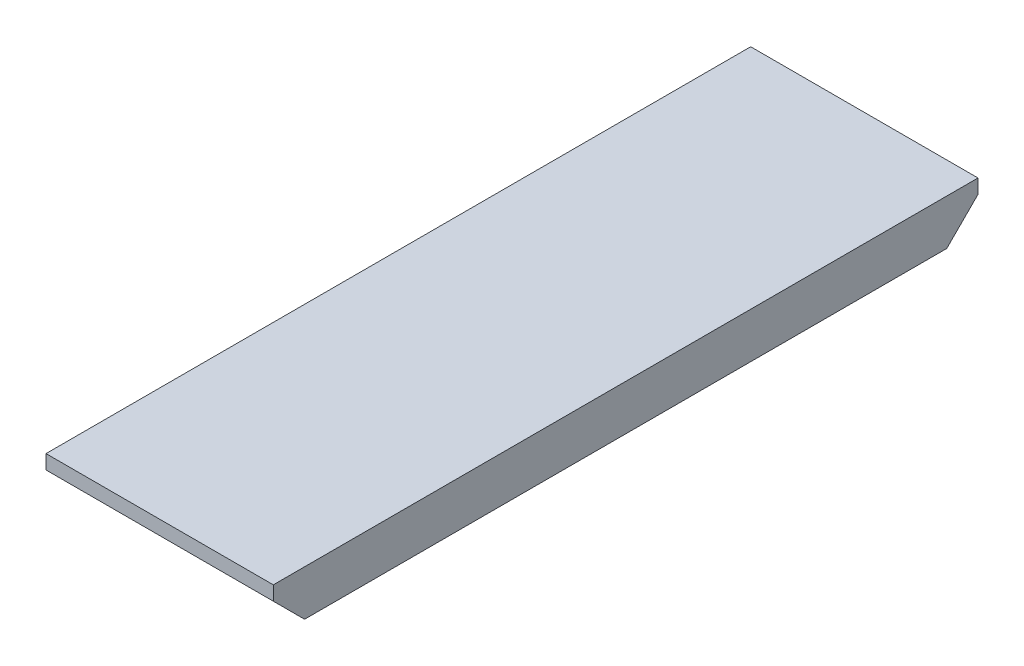
ISO-10303-21;
HEADER;
FILE_DESCRIPTION(('STEP AP214'),'2;1');
FILE_NAME('part.step','',(''),(''),'','','');
FILE_SCHEMA(('AUTOMOTIVE_DESIGN { 1 0 10303 214 1 1 1 1 }'));
ENDSEC;
DATA;
#1=APPLICATION_CONTEXT('core data for automotive mechanical design processes');
#2=APPLICATION_PROTOCOL_DEFINITION('international standard','automotive_design',2000,#1);
#3=PRODUCT_CONTEXT('',#1,'mechanical');
#4=PRODUCT('Part','Part','',(#3));
#5=PRODUCT_RELATED_PRODUCT_CATEGORY('part','',(#4));
#6=PRODUCT_DEFINITION_FORMATION('','',#4);
#7=PRODUCT_DEFINITION_CONTEXT('part definition',#1,'design');
#8=PRODUCT_DEFINITION('design','',#6,#7);
#9=PRODUCT_DEFINITION_SHAPE('','',#8);
#10=(LENGTH_UNIT() NAMED_UNIT(*) SI_UNIT(.MILLI.,.METRE.));
#11=(NAMED_UNIT(*) PLANE_ANGLE_UNIT() SI_UNIT($,.RADIAN.));
#12=(NAMED_UNIT(*) SI_UNIT($,.STERADIAN.) SOLID_ANGLE_UNIT());
#13=UNCERTAINTY_MEASURE_WITH_UNIT(LENGTH_MEASURE(1.E-05),#10,'distance_accuracy_value','');
#14=(GEOMETRIC_REPRESENTATION_CONTEXT(3) GLOBAL_UNCERTAINTY_ASSIGNED_CONTEXT((#13)) GLOBAL_UNIT_ASSIGNED_CONTEXT((#10,
#11,#12)) REPRESENTATION_CONTEXT('',''));
#15=CARTESIAN_POINT('',(0.,0.,0.));
#16=DIRECTION('',(0.,0.,1.));
#17=DIRECTION('',(1.,0.,0.));
#18=AXIS2_PLACEMENT_3D('',#15,#16,#17);
#19=CARTESIAN_POINT('',(7.1084333562851,-5.39646084594727,1.397));
#20=DIRECTION('',(0.,-0.707106781186548,-0.707106781186548));
#21=DIRECTION('',(0.,0.707106781186548,-0.707106781186548));
#22=AXIS2_PLACEMENT_3D('',#19,#20,#21);
#23=PLANE('',#22);
#24=DIRECTION('',(0.,0.707106781186547,-0.707106781186548));
#25=VECTOR('',#24,1.);
#26=CARTESIAN_POINT('',(12.1884333562851,-6.79346084594727,2.794));
#27=LINE('',#26,#25);
#28=CARTESIAN_POINT('',(12.1884333562851,-6.79346084594727,2.794));
#29=VERTEX_POINT('',#28);
#30=CARTESIAN_POINT('',(12.1884333562851,-3.99946084594727,0.));
#31=VERTEX_POINT('',#30);
#32=EDGE_CURVE('E70',#29,#31,#27,.T.);
#33=ORIENTED_EDGE('',*,*,#32,.F.);
#34=DIRECTION('',(1.,0.,0.));
#35=VECTOR('',#34,1.);
#36=CARTESIAN_POINT('',(12.1884333562851,-6.79346084594727,2.794));
#37=LINE('',#36,#35);
#38=CARTESIAN_POINT('',(-8.13156664371491,-6.79346084594727,2.794));
#39=VERTEX_POINT('',#38);
#40=EDGE_CURVE('E18',#39,#29,#37,.T.);
#41=ORIENTED_EDGE('',*,*,#40,.F.);
#42=DIRECTION('',(0.,-0.707106781186547,0.707106781186548));
#43=VECTOR('',#42,1.);
#44=CARTESIAN_POINT('',(-8.1315666437149,-3.99946084594727,0.));
#45=LINE('',#44,#43);
#46=CARTESIAN_POINT('',(-8.13156664371491,-3.99946084594727,0.));
#47=VERTEX_POINT('',#46);
#48=EDGE_CURVE('E108',#47,#39,#45,.T.);
#49=ORIENTED_EDGE('',*,*,#48,.F.);
#50=DIRECTION('',(1.,0.,0.));
#51=VECTOR('',#50,1.);
#52=CARTESIAN_POINT('',(2.0284333562851,-3.99946084594727,0.));
#53=LINE('',#52,#51);
#54=EDGE_CURVE('E73',#47,#31,#53,.T.);
#55=ORIENTED_EDGE('',*,*,#54,.T.);
#56=EDGE_LOOP('',(#33,#41,#49,#55));
#57=FACE_BOUND('',#56,.T.);
#58=ADVANCED_FACE('F15',(#57),#23,.T.);
#59=CARTESIAN_POINT('',(12.1884333562851,-6.79346084594727,0.));
#60=DIRECTION('',(0.,-1.,0.));
#61=DIRECTION('',(0.,0.,-1.));
#62=AXIS2_PLACEMENT_3D('',#59,#60,#61);
#63=PLANE('',#62);
#64=DIRECTION('',(1.,0.,0.));
#65=VECTOR('',#64,1.);
#66=CARTESIAN_POINT('',(7.1084333562851,-6.79346084594727,60.198));
#67=LINE('',#66,#65);
#68=CARTESIAN_POINT('',(-8.1315666437149,-6.79346084594727,60.198));
#69=VERTEX_POINT('',#68);
#70=CARTESIAN_POINT('',(12.1884333562851,-6.79346084594727,60.198));
#71=VERTEX_POINT('',#70);
#72=EDGE_CURVE('E87',#69,#71,#67,.T.);
#73=ORIENTED_EDGE('',*,*,#72,.F.);
#74=DIRECTION('',(0.,0.,1.));
#75=VECTOR('',#74,1.);
#76=CARTESIAN_POINT('',(-8.1315666437149,-6.79346084594727,0.));
#77=LINE('',#76,#75);
#78=EDGE_CURVE('E85',#39,#69,#77,.T.);
#79=ORIENTED_EDGE('',*,*,#78,.F.);
#80=ORIENTED_EDGE('',*,*,#40,.T.);
#81=DIRECTION('',(0.,0.,-1.));
#82=VECTOR('',#81,1.);
#83=CARTESIAN_POINT('',(12.1884333562851,-6.79346084594727,0.));
#84=LINE('',#83,#82);
#85=EDGE_CURVE('E82',#71,#29,#84,.T.);
#86=ORIENTED_EDGE('',*,*,#85,.F.);
#87=EDGE_LOOP('',(#73,#79,#80,#86));
#88=FACE_BOUND('',#87,.T.);
#89=ADVANCED_FACE('F81',(#88),#63,.T.);
#90=CARTESIAN_POINT('',(7.1084333562851,-5.39646084594727,61.595));
#91=DIRECTION('',(0.,-0.707106781186547,0.707106781186548));
#92=DIRECTION('',(0.,-0.707106781186548,-0.707106781186547));
#93=AXIS2_PLACEMENT_3D('',#90,#91,#92);
#94=PLANE('',#93);
#95=DIRECTION('',(0.,-0.707106781186547,-0.707106781186548));
#96=VECTOR('',#95,1.);
#97=CARTESIAN_POINT('',(12.1884333562851,-3.99946084594727,62.992));
#98=LINE('',#97,#96);
#99=CARTESIAN_POINT('',(12.1884333562851,-3.99946084594727,62.992));
#100=VERTEX_POINT('',#99);
#101=EDGE_CURVE('E90',#100,#71,#98,.T.);
#102=ORIENTED_EDGE('',*,*,#101,.F.);
#103=DIRECTION('',(1.,0.,0.));
#104=VECTOR('',#103,1.);
#105=CARTESIAN_POINT('',(2.0284333562851,-3.99946084594727,62.992));
#106=LINE('',#105,#104);
#107=CARTESIAN_POINT('',(-8.1315666437149,-3.99946084594727,62.992));
#108=VERTEX_POINT('',#107);
#109=EDGE_CURVE('E65',#108,#100,#106,.T.);
#110=ORIENTED_EDGE('',*,*,#109,.F.);
#111=DIRECTION('',(0.,0.707106781186547,0.707106781186548));
#112=VECTOR('',#111,1.);
#113=CARTESIAN_POINT('',(-8.1315666437149,-6.79346084594727,60.198));
#114=LINE('',#113,#112);
#115=EDGE_CURVE('E102',#69,#108,#114,.T.);
#116=ORIENTED_EDGE('',*,*,#115,.F.);
#117=ORIENTED_EDGE('',*,*,#72,.T.);
#118=EDGE_LOOP('',(#102,#110,#116,#117));
#119=FACE_BOUND('',#118,.T.);
#120=ADVANCED_FACE('F100',(#119),#94,.T.);
#121=CARTESIAN_POINT('',(2.0284333562851,-4.76146084594727,62.992));
#122=DIRECTION('',(0.,0.,1.));
#123=DIRECTION('',(1.,0.,0.));
#124=AXIS2_PLACEMENT_3D('',#121,#122,#123);
#125=PLANE('',#124);
#126=DIRECTION('',(-1.,0.,0.));
#127=VECTOR('',#126,1.);
#128=CARTESIAN_POINT('',(-8.1315666437149,-2.72946084594727,62.992));
#129=LINE('',#128,#127);
#130=CARTESIAN_POINT('',(-8.1315666437149,-2.72946084594727,62.992));
#131=VERTEX_POINT('',#130);
#132=CARTESIAN_POINT('',(12.1884333562851,-2.72946084594727,62.992));
#133=VERTEX_POINT('',#132);
#134=EDGE_CURVE('E114',#131,#133,#129,.F.);
#135=ORIENTED_EDGE('',*,*,#134,.F.);
#136=DIRECTION('',(0.,1.,0.));
#137=VECTOR('',#136,1.);
#138=CARTESIAN_POINT('',(-8.1315666437149,-6.79346084594727,62.992));
#139=LINE('',#138,#137);
#140=EDGE_CURVE('E105',#108,#131,#139,.T.);
#141=ORIENTED_EDGE('',*,*,#140,.F.);
#142=ORIENTED_EDGE('',*,*,#109,.T.);
#143=DIRECTION('',(0.,1.,0.));
#144=VECTOR('',#143,1.);
#145=CARTESIAN_POINT('',(12.1884333562851,-2.72946084594727,62.992));
#146=LINE('',#145,#144);
#147=EDGE_CURVE('E77',#133,#100,#146,.F.);
#148=ORIENTED_EDGE('',*,*,#147,.F.);
#149=EDGE_LOOP('',(#135,#141,#142,#148));
#150=FACE_BOUND('',#149,.T.);
#151=ADVANCED_FACE('F125',(#150),#125,.T.);
#152=CARTESIAN_POINT('',(12.1884333562851,-2.72946084594727,0.));
#153=DIRECTION('',(1.,0.,0.));
#154=DIRECTION('',(0.,0.,-1.));
#155=AXIS2_PLACEMENT_3D('',#152,#153,#154);
#156=PLANE('',#155);
#157=ORIENTED_EDGE('',*,*,#101,.T.);
#158=ORIENTED_EDGE('',*,*,#85,.T.);
#159=ORIENTED_EDGE('',*,*,#32,.T.);
#160=DIRECTION('',(0.,1.,0.));
#161=VECTOR('',#160,1.);
#162=CARTESIAN_POINT('',(12.1884333562851,-4.76146084594727,0.));
#163=LINE('',#162,#161);
#164=CARTESIAN_POINT('',(12.1884333562851,-2.72946084594727,0.));
#165=VERTEX_POINT('',#164);
#166=EDGE_CURVE('E91',#31,#165,#163,.T.);
#167=ORIENTED_EDGE('',*,*,#166,.T.);
#168=DIRECTION('',(0.,0.,1.));
#169=VECTOR('',#168,1.);
#170=CARTESIAN_POINT('',(12.1884333562851,-2.72946084594727,0.));
#171=LINE('',#170,#169);
#172=EDGE_CURVE('E117',#133,#165,#171,.F.);
#173=ORIENTED_EDGE('',*,*,#172,.F.);
#174=ORIENTED_EDGE('',*,*,#147,.T.);
#175=EDGE_LOOP('',(#157,#158,#159,#167,#173,#174));
#176=FACE_BOUND('',#175,.T.);
#177=ADVANCED_FACE('F88',(#176),#156,.T.);
#178=CARTESIAN_POINT('',(2.0284333562851,-4.76146084594727,0.));
#179=DIRECTION('',(0.,0.,1.));
#180=DIRECTION('',(1.,0.,0.));
#181=AXIS2_PLACEMENT_3D('',#178,#179,#180);
#182=PLANE('',#181);
#183=DIRECTION('',(0.,1.,0.));
#184=VECTOR('',#183,1.);
#185=CARTESIAN_POINT('',(-8.1315666437149,-6.79346084594727,0.));
#186=LINE('',#185,#184);
#187=CARTESIAN_POINT('',(-8.1315666437149,-2.72946084594727,0.));
#188=VERTEX_POINT('',#187);
#189=EDGE_CURVE('E33',#188,#47,#186,.F.);
#190=ORIENTED_EDGE('',*,*,#189,.F.);
#191=DIRECTION('',(-1.,0.,0.));
#192=VECTOR('',#191,1.);
#193=CARTESIAN_POINT('',(-8.1315666437149,-2.72946084594727,0.));
#194=LINE('',#193,#192);
#195=EDGE_CURVE('E24',#165,#188,#194,.T.);
#196=ORIENTED_EDGE('',*,*,#195,.F.);
#197=ORIENTED_EDGE('',*,*,#166,.F.);
#198=ORIENTED_EDGE('',*,*,#54,.F.);
#199=EDGE_LOOP('',(#190,#196,#197,#198));
#200=FACE_BOUND('',#199,.T.);
#201=ADVANCED_FACE('F124',(#200),#182,.F.);
#202=CARTESIAN_POINT('',(-8.1315666437149,-6.79346084594727,0.));
#203=DIRECTION('',(-1.,0.,0.));
#204=DIRECTION('',(0.,0.,1.));
#205=AXIS2_PLACEMENT_3D('',#202,#203,#204);
#206=PLANE('',#205);
#207=DIRECTION('',(0.,0.,1.));
#208=VECTOR('',#207,1.);
#209=CARTESIAN_POINT('',(-8.1315666437149,-2.72946084594727,0.));
#210=LINE('',#209,#208);
#211=EDGE_CURVE('E10',#188,#131,#210,.T.);
#212=ORIENTED_EDGE('',*,*,#211,.F.);
#213=ORIENTED_EDGE('',*,*,#189,.T.);
#214=ORIENTED_EDGE('',*,*,#48,.T.);
#215=ORIENTED_EDGE('',*,*,#78,.T.);
#216=ORIENTED_EDGE('',*,*,#115,.T.);
#217=ORIENTED_EDGE('',*,*,#140,.T.);
#218=EDGE_LOOP('',(#212,#213,#214,#215,#216,#217));
#219=FACE_BOUND('',#218,.T.);
#220=ADVANCED_FACE('F107',(#219),#206,.T.);
#221=CARTESIAN_POINT('',(-8.1315666437149,-2.72946084594727,0.));
#222=DIRECTION('',(0.,1.,0.));
#223=DIRECTION('',(-1.,0.,0.));
#224=AXIS2_PLACEMENT_3D('',#221,#222,#223);
#225=PLANE('',#224);
#226=ORIENTED_EDGE('',*,*,#195,.T.);
#227=ORIENTED_EDGE('',*,*,#211,.T.);
#228=ORIENTED_EDGE('',*,*,#134,.T.);
#229=ORIENTED_EDGE('',*,*,#172,.T.);
#230=EDGE_LOOP('',(#226,#227,#228,#229));
#231=FACE_BOUND('',#230,.T.);
#232=ADVANCED_FACE('F122',(#231),#225,.T.);
#233=CLOSED_SHELL('',(#58,#89,#120,#151,#177,#201,#220,#232));
#234=MANIFOLD_SOLID_BREP('B1',#233);
#235=ADVANCED_BREP_SHAPE_REPRESENTATION('',(#18,#234),#14);
#236=SHAPE_DEFINITION_REPRESENTATION(#9,#235);
ENDSEC;
END-ISO-10303-21;
